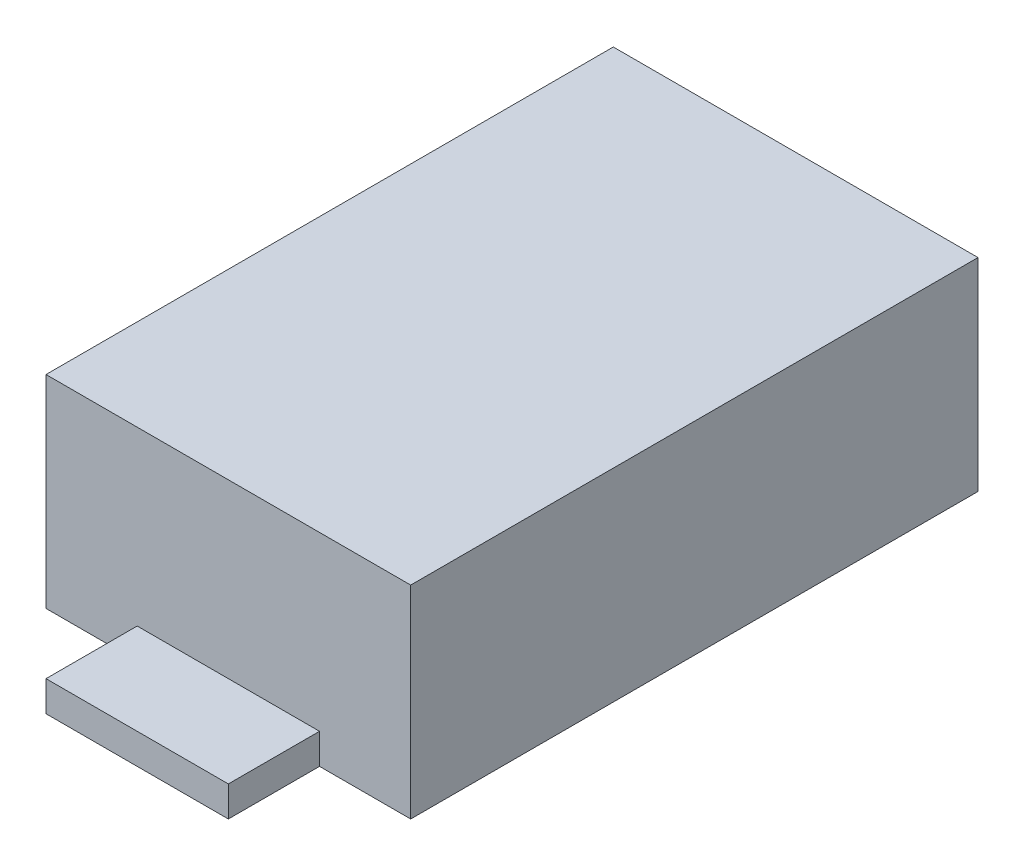
ISO-10303-21;
HEADER;
FILE_DESCRIPTION(('STEP AP214'),'2;1');
FILE_NAME('part.step','',(''),(''),'','','');
FILE_SCHEMA(('AUTOMOTIVE_DESIGN { 1 0 10303 214 1 1 1 1 }'));
ENDSEC;
DATA;
#1=APPLICATION_CONTEXT('core data for automotive mechanical design processes');
#2=APPLICATION_PROTOCOL_DEFINITION('international standard','automotive_design',2000,#1);
#3=PRODUCT_CONTEXT('',#1,'mechanical');
#4=PRODUCT('Part','Part','',(#3));
#5=PRODUCT_RELATED_PRODUCT_CATEGORY('part','',(#4));
#6=PRODUCT_DEFINITION_FORMATION('','',#4);
#7=PRODUCT_DEFINITION_CONTEXT('part definition',#1,'design');
#8=PRODUCT_DEFINITION('design','',#6,#7);
#9=PRODUCT_DEFINITION_SHAPE('','',#8);
#10=(LENGTH_UNIT() NAMED_UNIT(*) SI_UNIT(.MILLI.,.METRE.));
#11=(NAMED_UNIT(*) PLANE_ANGLE_UNIT() SI_UNIT($,.RADIAN.));
#12=(NAMED_UNIT(*) SI_UNIT($,.STERADIAN.) SOLID_ANGLE_UNIT());
#13=UNCERTAINTY_MEASURE_WITH_UNIT(LENGTH_MEASURE(1.E-05),#10,'distance_accuracy_value','');
#14=(GEOMETRIC_REPRESENTATION_CONTEXT(3) GLOBAL_UNCERTAINTY_ASSIGNED_CONTEXT((#13)) GLOBAL_UNIT_ASSIGNED_CONTEXT((#10,
#11,#12)) REPRESENTATION_CONTEXT('',''));
#15=CARTESIAN_POINT('',(0.,0.,0.));
#16=DIRECTION('',(0.,0.,1.));
#17=DIRECTION('',(1.,0.,0.));
#18=AXIS2_PLACEMENT_3D('',#15,#16,#17);
#19=CARTESIAN_POINT('',(-0.9,1.,-1.4));
#20=DIRECTION('',(0.,0.,1.));
#21=DIRECTION('',(1.,0.,0.));
#22=AXIS2_PLACEMENT_3D('',#19,#20,#21);
#23=PLANE('',#22);
#24=DIRECTION('',(1.,0.,0.));
#25=VECTOR('',#24,1.);
#26=CARTESIAN_POINT('',(0.,0.15,-1.4));
#27=LINE('',#26,#25);
#28=CARTESIAN_POINT('',(0.45,0.15,-1.4));
#29=VERTEX_POINT('',#28);
#30=CARTESIAN_POINT('',(-0.45,0.15,-1.4));
#31=VERTEX_POINT('',#30);
#32=EDGE_CURVE('E165',#29,#31,#27,.F.);
#33=ORIENTED_EDGE('',*,*,#32,.T.);
#34=DIRECTION('',(0.,1.,0.));
#35=VECTOR('',#34,1.);
#36=CARTESIAN_POINT('',(-0.45,1.,-1.4));
#37=LINE('',#36,#35);
#38=CARTESIAN_POINT('',(-0.45,0.,-1.4));
#39=VERTEX_POINT('',#38);
#40=EDGE_CURVE('E137',#39,#31,#37,.T.);
#41=ORIENTED_EDGE('',*,*,#40,.F.);
#42=DIRECTION('',(1.,0.,0.));
#43=VECTOR('',#42,1.);
#44=CARTESIAN_POINT('',(-0.9,0.,-1.4));
#45=LINE('',#44,#43);
#46=CARTESIAN_POINT('',(-0.9,0.,-1.4));
#47=VERTEX_POINT('',#46);
#48=EDGE_CURVE('E142',#47,#39,#45,.T.);
#49=ORIENTED_EDGE('',*,*,#48,.F.);
#50=DIRECTION('',(0.,1.,0.));
#51=VECTOR('',#50,1.);
#52=CARTESIAN_POINT('',(-0.9,1.,-1.4));
#53=LINE('',#52,#51);
#54=CARTESIAN_POINT('',(-0.9,1.,-1.4));
#55=VERTEX_POINT('',#54);
#56=EDGE_CURVE('E112',#55,#47,#53,.F.);
#57=ORIENTED_EDGE('',*,*,#56,.F.);
#58=DIRECTION('',(1.,0.,0.));
#59=VECTOR('',#58,1.);
#60=CARTESIAN_POINT('',(0.,1.,-1.4));
#61=LINE('',#60,#59);
#62=CARTESIAN_POINT('',(0.9,1.,-1.4));
#63=VERTEX_POINT('',#62);
#64=EDGE_CURVE('E108',#63,#55,#61,.F.);
#65=ORIENTED_EDGE('',*,*,#64,.F.);
#66=DIRECTION('',(0.,1.,0.));
#67=VECTOR('',#66,1.);
#68=CARTESIAN_POINT('',(0.9,1.,-1.4));
#69=LINE('',#68,#67);
#70=CARTESIAN_POINT('',(0.9,0.,-1.4));
#71=VERTEX_POINT('',#70);
#72=EDGE_CURVE('E105',#71,#63,#69,.T.);
#73=ORIENTED_EDGE('',*,*,#72,.F.);
#74=DIRECTION('',(1.,0.,0.));
#75=VECTOR('',#74,1.);
#76=CARTESIAN_POINT('',(-0.9,0.,-1.4));
#77=LINE('',#76,#75);
#78=CARTESIAN_POINT('',(0.45,0.,-1.4));
#79=VERTEX_POINT('',#78);
#80=EDGE_CURVE('E20',#79,#71,#77,.T.);
#81=ORIENTED_EDGE('',*,*,#80,.F.);
#82=DIRECTION('',(0.,1.,0.));
#83=VECTOR('',#82,1.);
#84=CARTESIAN_POINT('',(0.45,1.,-1.4));
#85=LINE('',#84,#83);
#86=EDGE_CURVE('E132',#29,#79,#85,.F.);
#87=ORIENTED_EDGE('',*,*,#86,.F.);
#88=EDGE_LOOP('',(#33,#41,#49,#57,#65,#73,#81,#87));
#89=FACE_BOUND('',#88,.T.);
#90=ADVANCED_FACE('F17',(#89),#23,.F.);
#91=CARTESIAN_POINT('',(-0.9,1.,1.4));
#92=DIRECTION('',(0.,0.,-1.));
#93=DIRECTION('',(-1.,0.,0.));
#94=AXIS2_PLACEMENT_3D('',#91,#92,#93);
#95=PLANE('',#94);
#96=DIRECTION('',(1.,0.,0.));
#97=VECTOR('',#96,1.);
#98=CARTESIAN_POINT('',(0.,0.15,1.4));
#99=LINE('',#98,#97);
#100=CARTESIAN_POINT('',(-0.45,0.15,1.4));
#101=VERTEX_POINT('',#100);
#102=CARTESIAN_POINT('',(0.45,0.15,1.4));
#103=VERTEX_POINT('',#102);
#104=EDGE_CURVE('E161',#101,#103,#99,.T.);
#105=ORIENTED_EDGE('',*,*,#104,.T.);
#106=DIRECTION('',(0.,1.,0.));
#107=VECTOR('',#106,1.);
#108=CARTESIAN_POINT('',(0.45,1.,1.4));
#109=LINE('',#108,#107);
#110=CARTESIAN_POINT('',(0.45,0.,1.4));
#111=VERTEX_POINT('',#110);
#112=EDGE_CURVE('E173',#111,#103,#109,.T.);
#113=ORIENTED_EDGE('',*,*,#112,.F.);
#114=DIRECTION('',(-1.,0.,0.));
#115=VECTOR('',#114,1.);
#116=CARTESIAN_POINT('',(-0.9,0.,1.4));
#117=LINE('',#116,#115);
#118=CARTESIAN_POINT('',(0.9,0.,1.4));
#119=VERTEX_POINT('',#118);
#120=EDGE_CURVE('E175',#119,#111,#117,.T.);
#121=ORIENTED_EDGE('',*,*,#120,.F.);
#122=DIRECTION('',(0.,1.,0.));
#123=VECTOR('',#122,1.);
#124=CARTESIAN_POINT('',(0.9,1.,1.4));
#125=LINE('',#124,#123);
#126=CARTESIAN_POINT('',(0.9,1.,1.4));
#127=VERTEX_POINT('',#126);
#128=EDGE_CURVE('E116',#127,#119,#125,.F.);
#129=ORIENTED_EDGE('',*,*,#128,.F.);
#130=DIRECTION('',(1.,0.,0.));
#131=VECTOR('',#130,1.);
#132=CARTESIAN_POINT('',(0.,1.,1.4));
#133=LINE('',#132,#131);
#134=CARTESIAN_POINT('',(-0.9,1.,1.4));
#135=VERTEX_POINT('',#134);
#136=EDGE_CURVE('E160',#135,#127,#133,.T.);
#137=ORIENTED_EDGE('',*,*,#136,.F.);
#138=DIRECTION('',(0.,1.,0.));
#139=VECTOR('',#138,1.);
#140=CARTESIAN_POINT('',(-0.9,1.,1.4));
#141=LINE('',#140,#139);
#142=CARTESIAN_POINT('',(-0.9,0.,1.4));
#143=VERTEX_POINT('',#142);
#144=EDGE_CURVE('E140',#143,#135,#141,.T.);
#145=ORIENTED_EDGE('',*,*,#144,.F.);
#146=DIRECTION('',(-1.,0.,0.));
#147=VECTOR('',#146,1.);
#148=CARTESIAN_POINT('',(-0.9,0.,1.4));
#149=LINE('',#148,#147);
#150=CARTESIAN_POINT('',(-0.45,0.,1.4));
#151=VERTEX_POINT('',#150);
#152=EDGE_CURVE('E136',#151,#143,#149,.T.);
#153=ORIENTED_EDGE('',*,*,#152,.F.);
#154=DIRECTION('',(0.,1.,0.));
#155=VECTOR('',#154,1.);
#156=CARTESIAN_POINT('',(-0.45,1.,1.4));
#157=LINE('',#156,#155);
#158=EDGE_CURVE('E170',#101,#151,#157,.F.);
#159=ORIENTED_EDGE('',*,*,#158,.F.);
#160=EDGE_LOOP('',(#105,#113,#121,#129,#137,#145,#153,#159));
#161=FACE_BOUND('',#160,.T.);
#162=ADVANCED_FACE('F179',(#161),#95,.F.);
#163=CARTESIAN_POINT('',(0.,0.15,0.));
#164=DIRECTION('',(0.,-1.,0.));
#165=DIRECTION('',(0.,0.,-1.));
#166=AXIS2_PLACEMENT_3D('',#163,#164,#165);
#167=PLANE('',#166);
#168=ORIENTED_EDGE('',*,*,#32,.F.);
#169=DIRECTION('',(0.,0.,1.));
#170=VECTOR('',#169,1.);
#171=CARTESIAN_POINT('',(0.45,0.15,-1.4));
#172=LINE('',#171,#170);
#173=CARTESIAN_POINT('',(0.45,0.15,-1.85));
#174=VERTEX_POINT('',#173);
#175=EDGE_CURVE('E134',#29,#174,#172,.F.);
#176=ORIENTED_EDGE('',*,*,#175,.T.);
#177=DIRECTION('',(1.,0.,0.));
#178=VECTOR('',#177,1.);
#179=CARTESIAN_POINT('',(-0.45,0.15,-1.85));
#180=LINE('',#179,#178);
#181=CARTESIAN_POINT('',(-0.45,0.15,-1.85));
#182=VERTEX_POINT('',#181);
#183=EDGE_CURVE('E200',#174,#182,#180,.F.);
#184=ORIENTED_EDGE('',*,*,#183,.T.);
#185=DIRECTION('',(0.,0.,-1.));
#186=VECTOR('',#185,1.);
#187=CARTESIAN_POINT('',(-0.45,0.15,-1.4));
#188=LINE('',#187,#186);
#189=EDGE_CURVE('E194',#182,#31,#188,.F.);
#190=ORIENTED_EDGE('',*,*,#189,.T.);
#191=EDGE_LOOP('',(#168,#176,#184,#190));
#192=FACE_BOUND('',#191,.T.);
#193=ADVANCED_FACE('F205',(#192),#167,.F.);
#194=CARTESIAN_POINT('',(0.,0.15,0.));
#195=DIRECTION('',(0.,-1.,0.));
#196=DIRECTION('',(0.,0.,-1.));
#197=AXIS2_PLACEMENT_3D('',#194,#195,#196);
#198=PLANE('',#197);
#199=DIRECTION('',(1.,0.,0.));
#200=VECTOR('',#199,1.);
#201=CARTESIAN_POINT('',(-0.45,0.15,1.85));
#202=LINE('',#201,#200);
#203=CARTESIAN_POINT('',(0.45,0.15,1.85));
#204=VERTEX_POINT('',#203);
#205=CARTESIAN_POINT('',(-0.45,0.15,1.85));
#206=VERTEX_POINT('',#205);
#207=EDGE_CURVE('E188',#204,#206,#202,.F.);
#208=ORIENTED_EDGE('',*,*,#207,.F.);
#209=DIRECTION('',(0.,0.,-1.));
#210=VECTOR('',#209,1.);
#211=CARTESIAN_POINT('',(0.45,0.15,1.4));
#212=LINE('',#211,#210);
#213=EDGE_CURVE('E181',#103,#204,#212,.F.);
#214=ORIENTED_EDGE('',*,*,#213,.F.);
#215=ORIENTED_EDGE('',*,*,#104,.F.);
#216=DIRECTION('',(0.,0.,1.));
#217=VECTOR('',#216,1.);
#218=CARTESIAN_POINT('',(-0.45,0.15,1.4));
#219=LINE('',#218,#217);
#220=EDGE_CURVE('E190',#206,#101,#219,.F.);
#221=ORIENTED_EDGE('',*,*,#220,.F.);
#222=EDGE_LOOP('',(#208,#214,#215,#221));
#223=FACE_BOUND('',#222,.T.);
#224=ADVANCED_FACE('F229',(#223),#198,.F.);
#225=CARTESIAN_POINT('',(0.,1.,0.));
#226=DIRECTION('',(0.,1.,0.));
#227=DIRECTION('',(0.,0.,1.));
#228=AXIS2_PLACEMENT_3D('',#225,#226,#227);
#229=PLANE('',#228);
#230=DIRECTION('',(0.,0.,-1.));
#231=VECTOR('',#230,1.);
#232=CARTESIAN_POINT('',(-0.9,1.,-1.4));
#233=LINE('',#232,#231);
#234=EDGE_CURVE('E156',#55,#135,#233,.F.);
#235=ORIENTED_EDGE('',*,*,#234,.T.);
#236=ORIENTED_EDGE('',*,*,#136,.T.);
#237=DIRECTION('',(0.,0.,1.));
#238=VECTOR('',#237,1.);
#239=CARTESIAN_POINT('',(0.9,1.,-1.4));
#240=LINE('',#239,#238);
#241=EDGE_CURVE('E129',#127,#63,#240,.F.);
#242=ORIENTED_EDGE('',*,*,#241,.T.);
#243=ORIENTED_EDGE('',*,*,#64,.T.);
#244=EDGE_LOOP('',(#235,#236,#242,#243));
#245=FACE_BOUND('',#244,.T.);
#246=ADVANCED_FACE('F158',(#245),#229,.T.);
#247=CARTESIAN_POINT('',(0.45,0.15,-1.4));
#248=DIRECTION('',(-1.,0.,0.));
#249=DIRECTION('',(0.,0.,1.));
#250=AXIS2_PLACEMENT_3D('',#247,#248,#249);
#251=PLANE('',#250);
#252=DIRECTION('',(0.,1.,0.));
#253=VECTOR('',#252,1.);
#254=CARTESIAN_POINT('',(0.45,0.15,-1.85));
#255=LINE('',#254,#253);
#256=CARTESIAN_POINT('',(0.45,0.,-1.85));
#257=VERTEX_POINT('',#256);
#258=EDGE_CURVE('E202',#257,#174,#255,.T.);
#259=ORIENTED_EDGE('',*,*,#258,.T.);
#260=ORIENTED_EDGE('',*,*,#175,.F.);
#261=ORIENTED_EDGE('',*,*,#86,.T.);
#262=DIRECTION('',(0.,0.,1.));
#263=VECTOR('',#262,1.);
#264=CARTESIAN_POINT('',(0.45,0.,0.));
#265=LINE('',#264,#263);
#266=EDGE_CURVE('E122',#79,#257,#265,.F.);
#267=ORIENTED_EDGE('',*,*,#266,.T.);
#268=EDGE_LOOP('',(#259,#260,#261,#267));
#269=FACE_BOUND('',#268,.T.);
#270=ADVANCED_FACE('F133',(#269),#251,.F.);
#271=CARTESIAN_POINT('',(-0.45,0.15,-1.85));
#272=DIRECTION('',(0.,0.,1.));
#273=DIRECTION('',(1.,0.,0.));
#274=AXIS2_PLACEMENT_3D('',#271,#272,#273);
#275=PLANE('',#274);
#276=DIRECTION('',(0.,1.,0.));
#277=VECTOR('',#276,1.);
#278=CARTESIAN_POINT('',(-0.45,0.15,-1.85));
#279=LINE('',#278,#277);
#280=CARTESIAN_POINT('',(-0.45,0.,-1.85));
#281=VERTEX_POINT('',#280);
#282=EDGE_CURVE('E197',#281,#182,#279,.T.);
#283=ORIENTED_EDGE('',*,*,#282,.T.);
#284=ORIENTED_EDGE('',*,*,#183,.F.);
#285=ORIENTED_EDGE('',*,*,#258,.F.);
#286=DIRECTION('',(1.,0.,0.));
#287=VECTOR('',#286,1.);
#288=CARTESIAN_POINT('',(0.,0.,-1.85));
#289=LINE('',#288,#287);
#290=EDGE_CURVE('E126',#257,#281,#289,.F.);
#291=ORIENTED_EDGE('',*,*,#290,.T.);
#292=EDGE_LOOP('',(#283,#284,#285,#291));
#293=FACE_BOUND('',#292,.T.);
#294=ADVANCED_FACE('F208',(#293),#275,.F.);
#295=CARTESIAN_POINT('',(-0.45,0.15,-1.4));
#296=DIRECTION('',(1.,0.,0.));
#297=DIRECTION('',(0.,0.,-1.));
#298=AXIS2_PLACEMENT_3D('',#295,#296,#297);
#299=PLANE('',#298);
#300=ORIENTED_EDGE('',*,*,#40,.T.);
#301=ORIENTED_EDGE('',*,*,#189,.F.);
#302=ORIENTED_EDGE('',*,*,#282,.F.);
#303=DIRECTION('',(0.,0.,1.));
#304=VECTOR('',#303,1.);
#305=CARTESIAN_POINT('',(-0.45,0.,0.));
#306=LINE('',#305,#304);
#307=EDGE_CURVE('E212',#281,#39,#306,.T.);
#308=ORIENTED_EDGE('',*,*,#307,.T.);
#309=EDGE_LOOP('',(#300,#301,#302,#308));
#310=FACE_BOUND('',#309,.T.);
#311=ADVANCED_FACE('F211',(#310),#299,.F.);
#312=CARTESIAN_POINT('',(-0.9,1.,-1.4));
#313=DIRECTION('',(1.,0.,0.));
#314=DIRECTION('',(0.,0.,-1.));
#315=AXIS2_PLACEMENT_3D('',#312,#313,#314);
#316=PLANE('',#315);
#317=ORIENTED_EDGE('',*,*,#144,.T.);
#318=ORIENTED_EDGE('',*,*,#234,.F.);
#319=ORIENTED_EDGE('',*,*,#56,.T.);
#320=DIRECTION('',(0.,0.,1.));
#321=VECTOR('',#320,1.);
#322=CARTESIAN_POINT('',(-0.9,0.,0.));
#323=LINE('',#322,#321);
#324=EDGE_CURVE('E154',#47,#143,#323,.T.);
#325=ORIENTED_EDGE('',*,*,#324,.T.);
#326=EDGE_LOOP('',(#317,#318,#319,#325));
#327=FACE_BOUND('',#326,.T.);
#328=ADVANCED_FACE('F152',(#327),#316,.F.);
#329=CARTESIAN_POINT('',(-0.45,0.15,1.4));
#330=DIRECTION('',(-1.,0.,0.));
#331=DIRECTION('',(0.,0.,1.));
#332=AXIS2_PLACEMENT_3D('',#329,#330,#331);
#333=PLANE('',#332);
#334=ORIENTED_EDGE('',*,*,#220,.T.);
#335=ORIENTED_EDGE('',*,*,#158,.T.);
#336=DIRECTION('',(0.,0.,1.));
#337=VECTOR('',#336,1.);
#338=CARTESIAN_POINT('',(-0.45,0.,0.));
#339=LINE('',#338,#337);
#340=CARTESIAN_POINT('',(-0.45,0.,1.85));
#341=VERTEX_POINT('',#340);
#342=EDGE_CURVE('E214',#151,#341,#339,.T.);
#343=ORIENTED_EDGE('',*,*,#342,.T.);
#344=DIRECTION('',(0.,1.,0.));
#345=VECTOR('',#344,1.);
#346=CARTESIAN_POINT('',(-0.45,0.15,1.85));
#347=LINE('',#346,#345);
#348=EDGE_CURVE('E186',#206,#341,#347,.F.);
#349=ORIENTED_EDGE('',*,*,#348,.F.);
#350=EDGE_LOOP('',(#334,#335,#343,#349));
#351=FACE_BOUND('',#350,.T.);
#352=ADVANCED_FACE('F235',(#351),#333,.T.);
#353=CARTESIAN_POINT('',(-0.45,0.15,1.85));
#354=DIRECTION('',(0.,0.,1.));
#355=DIRECTION('',(1.,0.,0.));
#356=AXIS2_PLACEMENT_3D('',#353,#354,#355);
#357=PLANE('',#356);
#358=ORIENTED_EDGE('',*,*,#207,.T.);
#359=ORIENTED_EDGE('',*,*,#348,.T.);
#360=DIRECTION('',(1.,0.,0.));
#361=VECTOR('',#360,1.);
#362=CARTESIAN_POINT('',(0.,0.,1.85));
#363=LINE('',#362,#361);
#364=CARTESIAN_POINT('',(0.45,0.,1.85));
#365=VERTEX_POINT('',#364);
#366=EDGE_CURVE('E219',#341,#365,#363,.T.);
#367=ORIENTED_EDGE('',*,*,#366,.T.);
#368=DIRECTION('',(0.,1.,0.));
#369=VECTOR('',#368,1.);
#370=CARTESIAN_POINT('',(0.45,0.15,1.85));
#371=LINE('',#370,#369);
#372=EDGE_CURVE('E35',#204,#365,#371,.F.);
#373=ORIENTED_EDGE('',*,*,#372,.F.);
#374=EDGE_LOOP('',(#358,#359,#367,#373));
#375=FACE_BOUND('',#374,.T.);
#376=ADVANCED_FACE('F232',(#375),#357,.T.);
#377=CARTESIAN_POINT('',(0.45,0.15,1.4));
#378=DIRECTION('',(1.,0.,0.));
#379=DIRECTION('',(0.,0.,-1.));
#380=AXIS2_PLACEMENT_3D('',#377,#378,#379);
#381=PLANE('',#380);
#382=ORIENTED_EDGE('',*,*,#213,.T.);
#383=ORIENTED_EDGE('',*,*,#372,.T.);
#384=DIRECTION('',(0.,0.,1.));
#385=VECTOR('',#384,1.);
#386=CARTESIAN_POINT('',(0.45,0.,0.));
#387=LINE('',#386,#385);
#388=EDGE_CURVE('E26',#365,#111,#387,.F.);
#389=ORIENTED_EDGE('',*,*,#388,.T.);
#390=ORIENTED_EDGE('',*,*,#112,.T.);
#391=EDGE_LOOP('',(#382,#383,#389,#390));
#392=FACE_BOUND('',#391,.T.);
#393=ADVANCED_FACE('F222',(#392),#381,.T.);
#394=CARTESIAN_POINT('',(0.9,1.,-1.4));
#395=DIRECTION('',(-1.,0.,0.));
#396=DIRECTION('',(0.,0.,1.));
#397=AXIS2_PLACEMENT_3D('',#394,#395,#396);
#398=PLANE('',#397);
#399=ORIENTED_EDGE('',*,*,#72,.T.);
#400=ORIENTED_EDGE('',*,*,#241,.F.);
#401=ORIENTED_EDGE('',*,*,#128,.T.);
#402=DIRECTION('',(0.,0.,1.));
#403=VECTOR('',#402,1.);
#404=CARTESIAN_POINT('',(0.9,0.,0.));
#405=LINE('',#404,#403);
#406=EDGE_CURVE('E11',#119,#71,#405,.F.);
#407=ORIENTED_EDGE('',*,*,#406,.T.);
#408=EDGE_LOOP('',(#399,#400,#401,#407));
#409=FACE_BOUND('',#408,.T.);
#410=ADVANCED_FACE('F115',(#409),#398,.F.);
#411=CARTESIAN_POINT('',(0.,0.,0.));
#412=DIRECTION('',(0.,1.,0.));
#413=DIRECTION('',(0.,0.,1.));
#414=AXIS2_PLACEMENT_3D('',#411,#412,#413);
#415=PLANE('',#414);
#416=ORIENTED_EDGE('',*,*,#120,.T.);
#417=ORIENTED_EDGE('',*,*,#388,.F.);
#418=ORIENTED_EDGE('',*,*,#366,.F.);
#419=ORIENTED_EDGE('',*,*,#342,.F.);
#420=ORIENTED_EDGE('',*,*,#152,.T.);
#421=ORIENTED_EDGE('',*,*,#324,.F.);
#422=ORIENTED_EDGE('',*,*,#48,.T.);
#423=ORIENTED_EDGE('',*,*,#307,.F.);
#424=ORIENTED_EDGE('',*,*,#290,.F.);
#425=ORIENTED_EDGE('',*,*,#266,.F.);
#426=ORIENTED_EDGE('',*,*,#80,.T.);
#427=ORIENTED_EDGE('',*,*,#406,.F.);
#428=EDGE_LOOP('',(#416,#417,#418,#419,#420,#421,#422,#423,#424,#425,#426,#427));
#429=FACE_BOUND('',#428,.T.);
#430=ADVANCED_FACE('F119',(#429),#415,.F.);
#431=CLOSED_SHELL('',(#90,#162,#193,#224,#246,#270,#294,#311,#328,#352,#376,#393,#410,#430));
#432=MANIFOLD_SOLID_BREP('B1',#431);
#433=ADVANCED_BREP_SHAPE_REPRESENTATION('',(#18,#432),#14);
#434=SHAPE_DEFINITION_REPRESENTATION(#9,#433);
ENDSEC;
END-ISO-10303-21;
